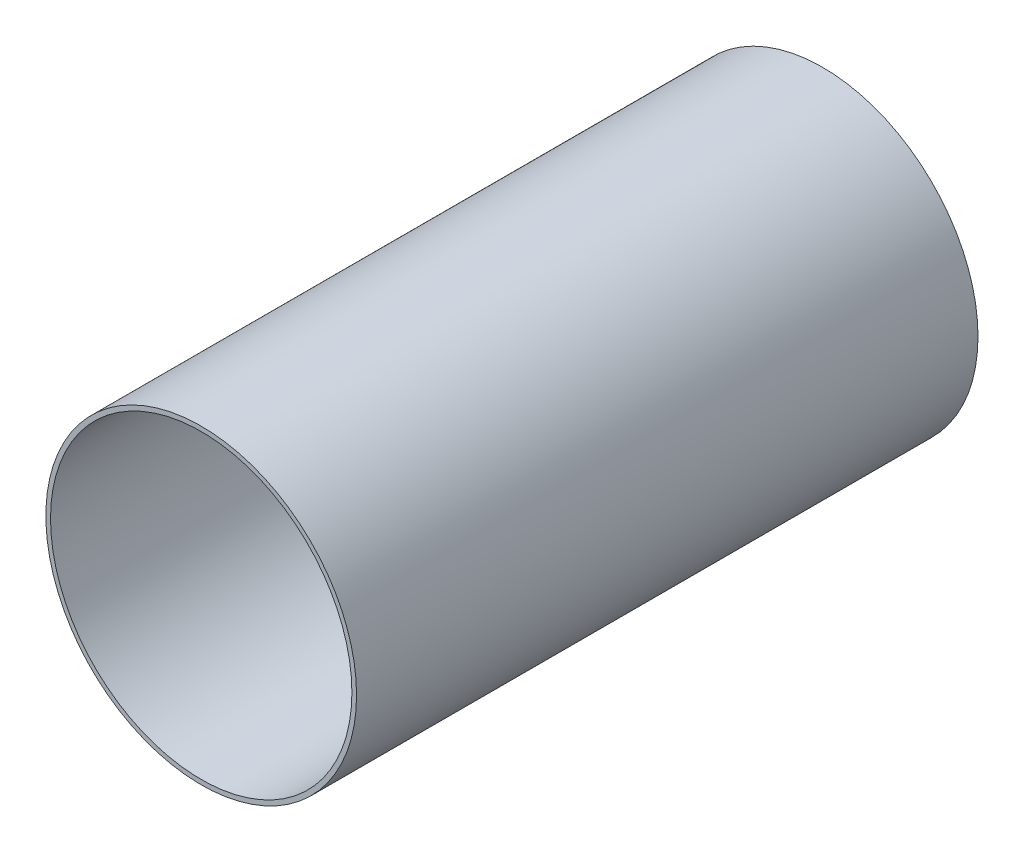
ISO-10303-21;
HEADER;
FILE_DESCRIPTION(('STEP AP214'),'2;1');
FILE_NAME('part.step','',(''),(''),'','','');
FILE_SCHEMA(('AUTOMOTIVE_DESIGN { 1 0 10303 214 1 1 1 1 }'));
ENDSEC;
DATA;
#1=APPLICATION_CONTEXT('core data for automotive mechanical design processes');
#2=APPLICATION_PROTOCOL_DEFINITION('international standard','automotive_design',2000,#1);
#3=PRODUCT_CONTEXT('',#1,'mechanical');
#4=PRODUCT('Part','Part','',(#3));
#5=PRODUCT_RELATED_PRODUCT_CATEGORY('part','',(#4));
#6=PRODUCT_DEFINITION_FORMATION('','',#4);
#7=PRODUCT_DEFINITION_CONTEXT('part definition',#1,'design');
#8=PRODUCT_DEFINITION('design','',#6,#7);
#9=PRODUCT_DEFINITION_SHAPE('','',#8);
#10=(LENGTH_UNIT() NAMED_UNIT(*) SI_UNIT(.MILLI.,.METRE.));
#11=(NAMED_UNIT(*) PLANE_ANGLE_UNIT() SI_UNIT($,.RADIAN.));
#12=(NAMED_UNIT(*) SI_UNIT($,.STERADIAN.) SOLID_ANGLE_UNIT());
#13=UNCERTAINTY_MEASURE_WITH_UNIT(LENGTH_MEASURE(1.E-05),#10,'distance_accuracy_value','');
#14=(GEOMETRIC_REPRESENTATION_CONTEXT(3) GLOBAL_UNCERTAINTY_ASSIGNED_CONTEXT((#13)) GLOBAL_UNIT_ASSIGNED_CONTEXT((#10,
#11,#12)) REPRESENTATION_CONTEXT('',''));
#15=CARTESIAN_POINT('',(0.,0.,0.));
#16=DIRECTION('',(0.,0.,1.));
#17=DIRECTION('',(1.,0.,0.));
#18=AXIS2_PLACEMENT_3D('',#15,#16,#17);
#19=CARTESIAN_POINT('',(0.,0.,304.8));
#20=DIRECTION('',(0.,0.,1.));
#21=DIRECTION('',(1.,0.,0.));
#22=AXIS2_PLACEMENT_3D('',#19,#20,#21);
#23=PLANE('',#22);
#24=CARTESIAN_POINT('',(0.,0.,304.8));
#25=DIRECTION('',(0.,0.,1.));
#26=DIRECTION('',(1.,0.,0.));
#27=AXIS2_PLACEMENT_3D('',#24,#25,#26);
#28=CIRCLE('',#27,76.2);
#29=CARTESIAN_POINT('',(76.2,0.,304.8));
#30=VERTEX_POINT('',#29);
#31=EDGE_CURVE('E10',#30,#30,#28,.T.);
#32=ORIENTED_EDGE('',*,*,#31,.T.);
#33=EDGE_LOOP('',(#32));
#34=FACE_BOUND('',#33,.T.);
#35=CARTESIAN_POINT('',(0.,0.,304.8));
#36=DIRECTION('',(0.,0.,1.));
#37=DIRECTION('',(1.,0.,0.));
#38=AXIS2_PLACEMENT_3D('',#35,#36,#37);
#39=CIRCLE('',#38,73.914);
#40=CARTESIAN_POINT('',(73.914,0.,304.8));
#41=VERTEX_POINT('',#40);
#42=EDGE_CURVE('E56',#41,#41,#39,.T.);
#43=ORIENTED_EDGE('',*,*,#42,.F.);
#44=EDGE_LOOP('',(#43));
#45=FACE_BOUND('',#44,.T.);
#46=ADVANCED_FACE('F43',(#34,#45),#23,.T.);
#47=CARTESIAN_POINT('',(0.,0.,0.));
#48=DIRECTION('',(0.,0.,1.));
#49=DIRECTION('',(1.,0.,0.));
#50=AXIS2_PLACEMENT_3D('',#47,#48,#49);
#51=PLANE('',#50);
#52=CARTESIAN_POINT('',(0.,0.,0.));
#53=DIRECTION('',(0.,0.,1.));
#54=DIRECTION('',(1.,0.,0.));
#55=AXIS2_PLACEMENT_3D('',#52,#53,#54);
#56=CIRCLE('',#55,76.2);
#57=CARTESIAN_POINT('',(76.2,0.,0.));
#58=VERTEX_POINT('',#57);
#59=EDGE_CURVE('E47',#58,#58,#56,.T.);
#60=ORIENTED_EDGE('',*,*,#59,.F.);
#61=EDGE_LOOP('',(#60));
#62=FACE_BOUND('',#61,.T.);
#63=CARTESIAN_POINT('',(0.,0.,0.));
#64=DIRECTION('',(0.,0.,1.));
#65=DIRECTION('',(1.,0.,0.));
#66=AXIS2_PLACEMENT_3D('',#63,#64,#65);
#67=CIRCLE('',#66,73.914);
#68=CARTESIAN_POINT('',(73.914,0.,0.));
#69=VERTEX_POINT('',#68);
#70=EDGE_CURVE('E58',#69,#69,#67,.T.);
#71=ORIENTED_EDGE('',*,*,#70,.T.);
#72=EDGE_LOOP('',(#71));
#73=FACE_BOUND('',#72,.T.);
#74=ADVANCED_FACE('F70',(#62,#73),#51,.F.);
#75=CARTESIAN_POINT('',(0.,0.,304.8));
#76=DIRECTION('',(0.,0.,-1.));
#77=DIRECTION('',(-1.,0.,0.));
#78=AXIS2_PLACEMENT_3D('',#75,#76,#77);
#79=CYLINDRICAL_SURFACE('',#78,76.2);
#80=ORIENTED_EDGE('',*,*,#31,.F.);
#81=EDGE_LOOP('',(#80));
#82=FACE_BOUND('',#81,.T.);
#83=ORIENTED_EDGE('',*,*,#59,.T.);
#84=EDGE_LOOP('',(#83));
#85=FACE_BOUND('',#84,.T.);
#86=ADVANCED_FACE('F45',(#82,#85),#79,.T.);
#87=CARTESIAN_POINT('',(0.,0.,304.8));
#88=DIRECTION('',(0.,0.,-1.));
#89=DIRECTION('',(-1.,0.,0.));
#90=AXIS2_PLACEMENT_3D('',#87,#88,#89);
#91=CYLINDRICAL_SURFACE('',#90,73.914);
#92=ORIENTED_EDGE('',*,*,#42,.T.);
#93=EDGE_LOOP('',(#92));
#94=FACE_BOUND('',#93,.T.);
#95=ORIENTED_EDGE('',*,*,#70,.F.);
#96=EDGE_LOOP('',(#95));
#97=FACE_BOUND('',#96,.T.);
#98=ADVANCED_FACE('F66',(#94,#97),#91,.F.);
#99=CLOSED_SHELL('',(#46,#74,#86,#98));
#100=MANIFOLD_SOLID_BREP('B2',#99);
#101=ADVANCED_BREP_SHAPE_REPRESENTATION('',(#18,#100),#14);
#102=SHAPE_DEFINITION_REPRESENTATION(#9,#101);
ENDSEC;
END-ISO-10303-21;
